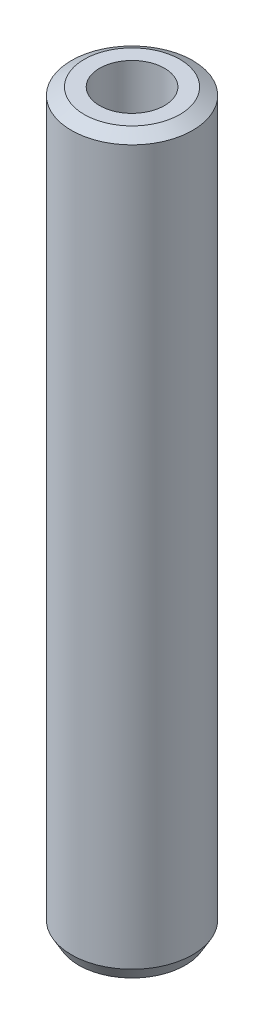
ISO-10303-21;
HEADER;
FILE_DESCRIPTION(('STEP AP214'),'2;1');
FILE_NAME('part.step','',(''),(''),'','','');
FILE_SCHEMA(('AUTOMOTIVE_DESIGN { 1 0 10303 214 1 1 1 1 }'));
ENDSEC;
DATA;
#1=APPLICATION_CONTEXT('core data for automotive mechanical design processes');
#2=APPLICATION_PROTOCOL_DEFINITION('international standard','automotive_design',2000,#1);
#3=PRODUCT_CONTEXT('',#1,'mechanical');
#4=PRODUCT('Part','Part','',(#3));
#5=PRODUCT_RELATED_PRODUCT_CATEGORY('part','',(#4));
#6=PRODUCT_DEFINITION_FORMATION('','',#4);
#7=PRODUCT_DEFINITION_CONTEXT('part definition',#1,'design');
#8=PRODUCT_DEFINITION('design','',#6,#7);
#9=PRODUCT_DEFINITION_SHAPE('','',#8);
#10=(LENGTH_UNIT() NAMED_UNIT(*) SI_UNIT(.MILLI.,.METRE.));
#11=(NAMED_UNIT(*) PLANE_ANGLE_UNIT() SI_UNIT($,.RADIAN.));
#12=(NAMED_UNIT(*) SI_UNIT($,.STERADIAN.) SOLID_ANGLE_UNIT());
#13=UNCERTAINTY_MEASURE_WITH_UNIT(LENGTH_MEASURE(1.E-05),#10,'distance_accuracy_value','');
#14=(GEOMETRIC_REPRESENTATION_CONTEXT(3) GLOBAL_UNCERTAINTY_ASSIGNED_CONTEXT((#13)) GLOBAL_UNIT_ASSIGNED_CONTEXT((#10,
#11,#12)) REPRESENTATION_CONTEXT('',''));
#15=CARTESIAN_POINT('',(0.,0.,0.));
#16=DIRECTION('',(0.,0.,1.));
#17=DIRECTION('',(1.,0.,0.));
#18=AXIS2_PLACEMENT_3D('',#15,#16,#17);
#19=CARTESIAN_POINT('',(0.,121.130850773433,0.));
#20=DIRECTION('',(0.,-1.,0.));
#21=DIRECTION('',(0.,0.,-1.));
#22=AXIS2_PLACEMENT_3D('',#19,#20,#21);
#23=CYLINDRICAL_SURFACE('',#22,10.);
#24=CARTESIAN_POINT('',(0.,119.912885123793,0.));
#25=DIRECTION('',(0.,1.,0.));
#26=DIRECTION('',(0.,0.,1.));
#27=AXIS2_PLACEMENT_3D('',#24,#25,#26);
#28=CIRCLE('',#27,10.);
#29=CARTESIAN_POINT('',(0.,119.912885123793,-10.));
#30=VERTEX_POINT('',#29);
#31=EDGE_CURVE('E50',#30,#30,#28,.F.);
#32=CARTESIAN_POINT('',(0.,2.10957838705039,0.));
#33=DIRECTION('',(0.,1.,0.));
#34=DIRECTION('',(0.,0.,1.));
#35=AXIS2_PLACEMENT_3D('',#32,#33,#34);
#36=CIRCLE('',#35,10.);
#37=CARTESIAN_POINT('',(0.,2.10957838705038,-10.));
#38=VERTEX_POINT('',#37);
#39=EDGE_CURVE('E51',#38,#38,#36,.T.);
#40=CARTESIAN_POINT('',(0.,119.912885123793,-10.));
#41=CARTESIAN_POINT('',(0.,118.685767345285,-10.));
#42=CARTESIAN_POINT('',(0.,117.458649566777,-10.));
#43=CARTESIAN_POINT('',(0.,115.004414009762,-10.));
#44=CARTESIAN_POINT('',(0.,113.777296231254,-10.));
#45=CARTESIAN_POINT('',(0.,111.323060674239,-10.));
#46=CARTESIAN_POINT('',(0.,110.095942895731,-10.));
#47=CARTESIAN_POINT('',(0.,107.641707338716,-10.));
#48=CARTESIAN_POINT('',(0.,106.414589560208,-10.));
#49=CARTESIAN_POINT('',(0.,103.960354003192,-10.));
#50=CARTESIAN_POINT('',(0.,102.733236224685,-10.));
#51=CARTESIAN_POINT('',(0.,100.279000667669,-10.));
#52=CARTESIAN_POINT('',(0.,99.0518828891614,-10.));
#53=CARTESIAN_POINT('',(0.,96.5976473321459,-10.));
#54=CARTESIAN_POINT('',(0.,95.3705295536382,-10.));
#55=CARTESIAN_POINT('',(0.,92.9162939966227,-10.));
#56=CARTESIAN_POINT('',(0.,91.689176218115,-10.));
#57=CARTESIAN_POINT('',(0.,89.2349406610995,-10.));
#58=CARTESIAN_POINT('',(0.,88.0078228825918,-10.));
#59=CARTESIAN_POINT('',(0.,85.5535873255763,-10.));
#60=CARTESIAN_POINT('',(0.,84.3264695470686,-10.));
#61=CARTESIAN_POINT('',(0.,81.8722339900531,-10.));
#62=CARTESIAN_POINT('',(0.,80.6451162115454,-10.));
#63=CARTESIAN_POINT('',(0.,78.1908806545299,-10.));
#64=CARTESIAN_POINT('',(0.,76.9637628760222,-10.));
#65=CARTESIAN_POINT('',(0.,74.5095273190067,-10.));
#66=CARTESIAN_POINT('',(0.,73.282409540499,-10.));
#67=CARTESIAN_POINT('',(0.,70.8281739834835,-10.));
#68=CARTESIAN_POINT('',(0.,69.6010562049757,-10.));
#69=CARTESIAN_POINT('',(0.,67.1468206479603,-10.));
#70=CARTESIAN_POINT('',(0.,65.9197028694526,-10.));
#71=CARTESIAN_POINT('',(0.,63.4654673124371,-10.));
#72=CARTESIAN_POINT('',(0.,62.2383495339294,-10.));
#73=CARTESIAN_POINT('',(0.,59.7841139769139,-10.));
#74=CARTESIAN_POINT('',(0.,58.5569961984062,-10.));
#75=CARTESIAN_POINT('',(0.,56.1027606413907,-10.));
#76=CARTESIAN_POINT('',(0.,54.875642862883,-10.));
#77=CARTESIAN_POINT('',(0.,52.4214073058675,-10.));
#78=CARTESIAN_POINT('',(0.,51.1942895273598,-10.));
#79=CARTESIAN_POINT('',(0.,48.7400539703443,-10.));
#80=CARTESIAN_POINT('',(0.,47.5129361918365,-10.));
#81=CARTESIAN_POINT('',(0.,45.0587006348211,-10.));
#82=CARTESIAN_POINT('',(0.,43.8315828563133,-10.));
#83=CARTESIAN_POINT('',(0.,41.3773472992979,-10.));
#84=CARTESIAN_POINT('',(0.,40.1502295207901,-10.));
#85=CARTESIAN_POINT('',(0.,37.6959939637747,-10.));
#86=CARTESIAN_POINT('',(0.,36.4688761852669,-10.));
#87=CARTESIAN_POINT('',(0.,34.0146406282515,-10.));
#88=CARTESIAN_POINT('',(0.,32.7875228497437,-10.));
#89=CARTESIAN_POINT('',(0.,30.3332872927283,-10.));
#90=CARTESIAN_POINT('',(0.,29.1061695142205,-10.));
#91=CARTESIAN_POINT('',(0.,26.6519339572051,-10.));
#92=CARTESIAN_POINT('',(0.,25.4248161786973,-10.));
#93=CARTESIAN_POINT('',(0.,22.9705806216819,-10.));
#94=CARTESIAN_POINT('',(0.,21.7434628431741,-10.));
#95=CARTESIAN_POINT('',(0.,19.2892272861587,-10.));
#96=CARTESIAN_POINT('',(0.,18.0621095076509,-10.));
#97=CARTESIAN_POINT('',(0.,15.6078739506355,-10.));
#98=CARTESIAN_POINT('',(0.,14.3807561721277,-10.));
#99=CARTESIAN_POINT('',(0.,11.9265206151123,-10.));
#100=CARTESIAN_POINT('',(0.,10.6994028366045,-10.));
#101=CARTESIAN_POINT('',(0.,8.24516727958905,-10.));
#102=CARTESIAN_POINT('',(0.,7.01804950108132,-10.));
#103=CARTESIAN_POINT('',(0.,4.56381394406585,-10.));
#104=CARTESIAN_POINT('',(0.,3.33669616555811,-10.));
#105=CARTESIAN_POINT('',(0.,2.10957838705038,-10.));
#106=B_SPLINE_CURVE_WITH_KNOTS('',3,(#40,#41,#42,#43,#44,#45,#46,#47,#48,#49,#50,#51,#52,#53,
#54,#55,#56,#57,#58,#59,#60,#61,#62,#63,#64,#65,#66,#67,#68,#69,#70,#71,#72,#73,#74,#75,#76,#77,
#78,#79,#80,#81,#82,#83,#84,#85,#86,#87,#88,#89,#90,#91,#92,#93,#94,#95,#96,#97,#98,#99,#100,
#101,#102,#103,#104,#105),.UNSPECIFIED.,.F.,.F.,(4,2,2,2,2,2,2,2,2,2,2,2,2,2,2,2,2,2,2,2,2,2,2,
2,2,2,2,2,2,2,2,2,4),(0.,3.68135333552319,7.3627066710464,11.0440600065696,14.7254133420928,
18.406766677616,22.0881200131392,25.7694733486624,29.4508266841856,33.1321800197088,
36.813533355232,40.4948866907552,44.1762400262784,47.8575933618016,51.5389466973248,
55.220300032848,58.9016533683712,62.5830067038944,66.2643600394176,69.9457133749408,
73.627066710464,77.3084200459872,80.9897733815104,84.6711267170336,88.3524800525568,
92.0338333880801,95.7151867236033,99.3965400591265,103.07789339465,106.759246730173,
110.440600065696,114.121953401219,117.803306736742),.UNSPECIFIED.);
#107=EDGE_CURVE('BSEAM39',#30,#38,#106,.T.);
#108=ORIENTED_EDGE('',*,*,#31,.T.);
#109=ORIENTED_EDGE('',*,*,#39,.T.);
#110=ORIENTED_EDGE('',*,*,#107,.T.);
#111=ORIENTED_EDGE('',*,*,#107,.F.);
#112=EDGE_LOOP('',(#108,#110,#109,#111));
#113=FACE_BOUND('',#112,.T.);
#114=ADVANCED_FACE('F39',(#113),#23,.T.);
#115=CARTESIAN_POINT('',(0.,121.130850773433,0.));
#116=DIRECTION('',(0.,1.,0.));
#117=DIRECTION('',(0.,0.,1.));
#118=AXIS2_PLACEMENT_3D('',#115,#116,#117);
#119=PLANE('',#118);
#120=CARTESIAN_POINT('',(0.,121.130850773433,0.));
#121=DIRECTION('',(0.,1.,0.));
#122=DIRECTION('',(0.,0.,1.));
#123=AXIS2_PLACEMENT_3D('',#120,#121,#122);
#124=CIRCLE('',#123,7.89042161294995);
#125=CARTESIAN_POINT('',(0.,121.130850773433,7.89042161294995));
#126=VERTEX_POINT('',#125);
#127=EDGE_CURVE('E54',#126,#126,#124,.T.);
#128=ORIENTED_EDGE('',*,*,#127,.T.);
#129=EDGE_LOOP('',(#128));
#130=FACE_BOUND('',#129,.T.);
#131=CARTESIAN_POINT('',(0.,121.130850773433,0.));
#132=DIRECTION('',(0.,1.,0.));
#133=DIRECTION('',(0.,0.,1.));
#134=AXIS2_PLACEMENT_3D('',#131,#132,#133);
#135=CIRCLE('',#134,5.35204026439475);
#136=CARTESIAN_POINT('',(0.,121.130850773433,-5.35204026439475));
#137=VERTEX_POINT('',#136);
#138=EDGE_CURVE('E58',#137,#137,#135,.T.);
#139=ORIENTED_EDGE('',*,*,#138,.F.);
#140=EDGE_LOOP('',(#139));
#141=FACE_BOUND('',#140,.T.);
#142=ADVANCED_FACE('F69',(#130,#141),#119,.T.);
#143=CARTESIAN_POINT('',(0.,0.,0.));
#144=DIRECTION('',(0.,1.,0.));
#145=DIRECTION('',(0.,0.,1.));
#146=AXIS2_PLACEMENT_3D('',#143,#144,#145);
#147=PLANE('',#146);
#148=CARTESIAN_POINT('',(0.,0.,0.));
#149=DIRECTION('',(0.,1.,0.));
#150=DIRECTION('',(0.,0.,1.));
#151=AXIS2_PLACEMENT_3D('',#148,#149,#150);
#152=CIRCLE('',#151,8.78203435035984);
#153=CARTESIAN_POINT('',(0.,0.,8.78203435035984));
#154=VERTEX_POINT('',#153);
#155=EDGE_CURVE('E10',#154,#154,#152,.F.);
#156=ORIENTED_EDGE('',*,*,#155,.T.);
#157=EDGE_LOOP('',(#156));
#158=FACE_BOUND('',#157,.T.);
#159=CARTESIAN_POINT('',(0.,0.,0.));
#160=DIRECTION('',(0.,1.,0.));
#161=DIRECTION('',(0.,0.,1.));
#162=AXIS2_PLACEMENT_3D('',#159,#160,#161);
#163=CIRCLE('',#162,5.35204026439475);
#164=CARTESIAN_POINT('',(0.,0.,-5.35204026439475));
#165=VERTEX_POINT('',#164);
#166=EDGE_CURVE('E63',#165,#165,#163,.T.);
#167=ORIENTED_EDGE('',*,*,#166,.T.);
#168=EDGE_LOOP('',(#167));
#169=FACE_BOUND('',#168,.T.);
#170=ADVANCED_FACE('F75',(#158,#169),#147,.F.);
#171=CARTESIAN_POINT('',(0.,121.130850773433,0.));
#172=DIRECTION('',(0.,-1.,0.));
#173=DIRECTION('',(0.,0.,-1.));
#174=AXIS2_PLACEMENT_3D('',#171,#172,#173);
#175=CYLINDRICAL_SURFACE('',#174,5.35204026439475);
#176=CARTESIAN_POINT('',(0.,121.130850773433,-5.35204026439475));
#177=CARTESIAN_POINT('',(0.,119.869071077876,-5.35204026439475));
#178=CARTESIAN_POINT('',(0.,118.60729138232,-5.35204026439475));
#179=CARTESIAN_POINT('',(0.,116.083731991206,-5.35204026439475));
#180=CARTESIAN_POINT('',(0.,114.82195229565,-5.35204026439475));
#181=CARTESIAN_POINT('',(0.,112.298392904537,-5.35204026439475));
#182=CARTESIAN_POINT('',(0.,111.03661320898,-5.35204026439475));
#183=CARTESIAN_POINT('',(0.,108.513053817867,-5.35204026439475));
#184=CARTESIAN_POINT('',(0.,107.25127412231,-5.35204026439475));
#185=CARTESIAN_POINT('',(0.,104.727714731197,-5.35204026439475));
#186=CARTESIAN_POINT('',(0.,103.465935035641,-5.35204026439475));
#187=CARTESIAN_POINT('',(0.,100.942375644527,-5.35204026439475));
#188=CARTESIAN_POINT('',(0.,99.6805959489708,-5.35204026439475));
#189=CARTESIAN_POINT('',(0.,97.1570365578576,-5.35204026439475));
#190=CARTESIAN_POINT('',(0.,95.895256862301,-5.35204026439475));
#191=CARTESIAN_POINT('',(0.,93.3716974711878,-5.35204026439475));
#192=CARTESIAN_POINT('',(0.,92.1099177756312,-5.35204026439475));
#193=CARTESIAN_POINT('',(0.,89.586358384518,-5.35204026439475));
#194=CARTESIAN_POINT('',(0.,88.3245786889614,-5.35204026439475));
#195=CARTESIAN_POINT('',(0.,85.8010192978483,-5.35204026439475));
#196=CARTESIAN_POINT('',(0.,84.5392396022916,-5.35204026439475));
#197=CARTESIAN_POINT('',(0.,82.0156802111785,-5.35204026439475));
#198=CARTESIAN_POINT('',(0.,80.7539005156219,-5.35204026439475));
#199=CARTESIAN_POINT('',(0.,78.2303411245087,-5.35204026439475));
#200=CARTESIAN_POINT('',(0.,76.9685614289521,-5.35204026439475));
#201=CARTESIAN_POINT('',(0.,74.4450020378389,-5.35204026439475));
#202=CARTESIAN_POINT('',(0.,73.1832223422823,-5.35204026439475));
#203=CARTESIAN_POINT('',(0.,70.6596629511691,-5.35204026439475));
#204=CARTESIAN_POINT('',(0.,69.3978832556125,-5.35204026439475));
#205=CARTESIAN_POINT('',(0.,66.8743238644994,-5.35204026439475));
#206=CARTESIAN_POINT('',(0.,65.6125441689428,-5.35204026439475));
#207=CARTESIAN_POINT('',(0.,63.0889847778296,-5.35204026439475));
#208=CARTESIAN_POINT('',(0.,61.827205082273,-5.35204026439475));
#209=CARTESIAN_POINT('',(0.,59.3036456911598,-5.35204026439475));
#210=CARTESIAN_POINT('',(0.,58.0418659956032,-5.35204026439475));
#211=CARTESIAN_POINT('',(0.,55.51830660449,-5.35204026439475));
#212=CARTESIAN_POINT('',(0.,54.2565269089335,-5.35204026439475));
#213=CARTESIAN_POINT('',(0.,51.7329675178203,-5.35204026439475));
#214=CARTESIAN_POINT('',(0.,50.4711878222637,-5.35204026439475));
#215=CARTESIAN_POINT('',(0.,47.9476284311505,-5.35204026439475));
#216=CARTESIAN_POINT('',(0.,46.6858487355939,-5.35204026439475));
#217=CARTESIAN_POINT('',(0.,44.1622893444807,-5.35204026439475));
#218=CARTESIAN_POINT('',(0.,42.9005096489241,-5.35204026439475));
#219=CARTESIAN_POINT('',(0.,40.3769502578109,-5.35204026439475));
#220=CARTESIAN_POINT('',(0.,39.1151705622543,-5.35204026439475));
#221=CARTESIAN_POINT('',(0.,36.5916111711412,-5.35204026439475));
#222=CARTESIAN_POINT('',(0.,35.3298314755846,-5.35204026439475));
#223=CARTESIAN_POINT('',(0.,32.8062720844714,-5.35204026439475));
#224=CARTESIAN_POINT('',(0.,31.5444923889148,-5.35204026439475));
#225=CARTESIAN_POINT('',(0.,29.0209329978016,-5.35204026439475));
#226=CARTESIAN_POINT('',(0.,27.759153302245,-5.35204026439475));
#227=CARTESIAN_POINT('',(0.,25.2355939111318,-5.35204026439475));
#228=CARTESIAN_POINT('',(0.,23.9738142155752,-5.35204026439475));
#229=CARTESIAN_POINT('',(0.,21.4502548244621,-5.35204026439475));
#230=CARTESIAN_POINT('',(0.,20.1884751289055,-5.35204026439475));
#231=CARTESIAN_POINT('',(0.,17.6649157377923,-5.35204026439475));
#232=CARTESIAN_POINT('',(0.,16.4031360422357,-5.35204026439475));
#233=CARTESIAN_POINT('',(0.,13.8795766511225,-5.35204026439475));
#234=CARTESIAN_POINT('',(0.,12.6177969555659,-5.35204026439475));
#235=CARTESIAN_POINT('',(0.,10.0942375644527,-5.35204026439475));
#236=CARTESIAN_POINT('',(0.,8.83245786889613,-5.35204026439475));
#237=CARTESIAN_POINT('',(0.,6.30889847778295,-5.35204026439475));
#238=CARTESIAN_POINT('',(0.,5.04711878222636,-5.35204026439475));
#239=CARTESIAN_POINT('',(0.,2.52355939111317,-5.35204026439475));
#240=CARTESIAN_POINT('',(0.,1.26177969555658,-5.35204026439475));
#241=CARTESIAN_POINT('',(0.,0.,-5.35204026439475));
#242=B_SPLINE_CURVE_WITH_KNOTS('',3,(#176,#177,#178,#179,#180,#181,#182,#183,#184,#185,#186,
#187,#188,#189,#190,#191,#192,#193,#194,#195,#196,#197,#198,#199,#200,#201,#202,#203,#204,#205,
#206,#207,#208,#209,#210,#211,#212,#213,#214,#215,#216,#217,#218,#219,#220,#221,#222,#223,#224,
#225,#226,#227,#228,#229,#230,#231,#232,#233,#234,#235,#236,#237,#238,#239,#240,#241),
.UNSPECIFIED.,.F.,.F.,(4,2,2,2,2,2,2,2,2,2,2,2,2,2,2,2,2,2,2,2,2,2,2,2,2,2,2,2,2,2,2,2,4),(0.,
3.78533908666978,7.57067817333956,11.3560172600093,15.1413563466791,18.9266954333489,
22.7120345200187,26.4973736066884,30.2827126933582,34.068051780028,37.8533908666978,
41.6387299533675,45.4240690400373,49.2094081267071,52.9947472133769,56.7800863000467,
60.5654253867164,64.3507644733862,68.136103560056,71.9214426467258,75.7067817333955,
79.4921208200653,83.2774599067351,87.0627989934049,90.8481380800746,94.6334771667444,
98.4188162534142,102.204155340084,105.989494426754,109.774833513424,113.560172600093,
117.345511686763,121.130850773433),.UNSPECIFIED.);
#243=EDGE_CURVE('BSEAM70',#137,#165,#242,.T.);
#244=ORIENTED_EDGE('',*,*,#138,.T.);
#245=ORIENTED_EDGE('',*,*,#166,.F.);
#246=ORIENTED_EDGE('',*,*,#243,.T.);
#247=ORIENTED_EDGE('',*,*,#243,.F.);
#248=EDGE_LOOP('',(#244,#246,#245,#247));
#249=FACE_BOUND('',#248,.T.);
#250=ADVANCED_FACE('F70',(#249),#175,.F.);
#251=CARTESIAN_POINT('',(0.,121.130850773433,0.));
#252=DIRECTION('',(0.,-1.,0.));
#253=DIRECTION('',(0.,0.,-1.));
#254=AXIS2_PLACEMENT_3D('',#251,#252,#253);
#255=CONICAL_SURFACE('',#254,7.89042161294995,1.0471975511966);
#256=ORIENTED_EDGE('',*,*,#31,.F.);
#257=EDGE_LOOP('',(#256));
#258=FACE_BOUND('',#257,.T.);
#259=ORIENTED_EDGE('',*,*,#127,.F.);
#260=EDGE_LOOP('',(#259));
#261=FACE_BOUND('',#260,.T.);
#262=ADVANCED_FACE('F81',(#258,#261),#255,.T.);
#263=CARTESIAN_POINT('',(0.,2.10957838705039,0.));
#264=DIRECTION('',(0.,1.,0.));
#265=DIRECTION('',(0.,0.,1.));
#266=AXIS2_PLACEMENT_3D('',#263,#264,#265);
#267=CONICAL_SURFACE('',#266,10.,0.5235987755983);
#268=ORIENTED_EDGE('',*,*,#155,.F.);
#269=EDGE_LOOP('',(#268));
#270=FACE_BOUND('',#269,.T.);
#271=ORIENTED_EDGE('',*,*,#39,.F.);
#272=EDGE_LOOP('',(#271));
#273=FACE_BOUND('',#272,.T.);
#274=ADVANCED_FACE('F45',(#270,#273),#267,.T.);
#275=CLOSED_SHELL('',(#114,#142,#170,#250,#262,#274));
#276=MANIFOLD_SOLID_BREP('B2',#275);
#277=ADVANCED_BREP_SHAPE_REPRESENTATION('',(#18,#276),#14);
#278=SHAPE_DEFINITION_REPRESENTATION(#9,#277);
ENDSEC;
END-ISO-10303-21;
